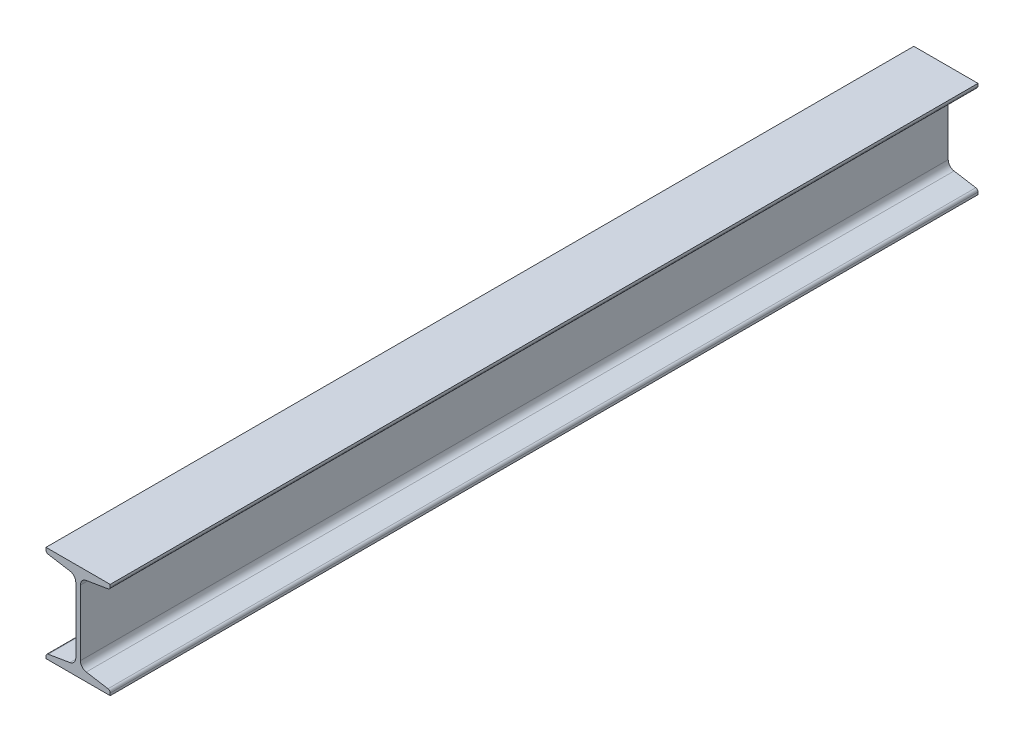
ISO-10303-21;
HEADER;
FILE_DESCRIPTION(('STEP AP214'),'2;1');
FILE_NAME('part.step','',(''),(''),'','','');
FILE_SCHEMA(('AUTOMOTIVE_DESIGN { 1 0 10303 214 1 1 1 1 }'));
ENDSEC;
DATA;
#1=APPLICATION_CONTEXT('core data for automotive mechanical design processes');
#2=APPLICATION_PROTOCOL_DEFINITION('international standard','automotive_design',2000,#1);
#3=PRODUCT_CONTEXT('',#1,'mechanical');
#4=PRODUCT('Part','Part','',(#3));
#5=PRODUCT_RELATED_PRODUCT_CATEGORY('part','',(#4));
#6=PRODUCT_DEFINITION_FORMATION('','',#4);
#7=PRODUCT_DEFINITION_CONTEXT('part definition',#1,'design');
#8=PRODUCT_DEFINITION('design','',#6,#7);
#9=PRODUCT_DEFINITION_SHAPE('','',#8);
#10=(LENGTH_UNIT() NAMED_UNIT(*) SI_UNIT(.MILLI.,.METRE.));
#11=(NAMED_UNIT(*) PLANE_ANGLE_UNIT() SI_UNIT($,.RADIAN.));
#12=(NAMED_UNIT(*) SI_UNIT($,.STERADIAN.) SOLID_ANGLE_UNIT());
#13=UNCERTAINTY_MEASURE_WITH_UNIT(LENGTH_MEASURE(1.E-05),#10,'distance_accuracy_value','');
#14=(GEOMETRIC_REPRESENTATION_CONTEXT(3) GLOBAL_UNCERTAINTY_ASSIGNED_CONTEXT((#13)) GLOBAL_UNIT_ASSIGNED_CONTEXT((#10,
#11,#12)) REPRESENTATION_CONTEXT('',''));
#15=CARTESIAN_POINT('',(0.,0.,0.));
#16=DIRECTION('',(0.,0.,1.));
#17=DIRECTION('',(1.,0.,0.));
#18=AXIS2_PLACEMENT_3D('',#15,#16,#17);
#19=CARTESIAN_POINT('',(67.6402,-4.55151905319634E-13,457.2));
#20=DIRECTION('',(0.,-1.,0.));
#21=DIRECTION('',(1.,0.,0.));
#22=AXIS2_PLACEMENT_3D('',#19,#20,#21);
#23=PLANE('',#22);
#24=DIRECTION('',(-1.,0.,0.));
#25=VECTOR('',#24,1.);
#26=CARTESIAN_POINT('',(67.6402,-4.55151905319634E-13,-457.2));
#27=LINE('',#26,#25);
#28=CARTESIAN_POINT('',(67.6402,-4.55151905319634E-13,-457.2));
#29=VERTEX_POINT('',#28);
#30=CARTESIAN_POINT('',(0.,0.,-457.2));
#31=VERTEX_POINT('',#30);
#32=EDGE_CURVE('E231',#29,#31,#27,.T.);
#33=ORIENTED_EDGE('',*,*,#32,.F.);
#34=DIRECTION('',(0.,0.,-1.));
#35=VECTOR('',#34,1.);
#36=CARTESIAN_POINT('',(67.6402,-4.55151905319634E-13,457.2));
#37=LINE('',#36,#35);
#38=CARTESIAN_POINT('',(67.6402,-4.55151905319634E-13,457.2));
#39=VERTEX_POINT('',#38);
#40=EDGE_CURVE('E189',#39,#29,#37,.T.);
#41=ORIENTED_EDGE('',*,*,#40,.F.);
#42=DIRECTION('',(-1.,0.,0.));
#43=VECTOR('',#42,1.);
#44=CARTESIAN_POINT('',(67.6402,-4.55151905319634E-13,457.2));
#45=LINE('',#44,#43);
#46=CARTESIAN_POINT('',(0.,0.,457.2));
#47=VERTEX_POINT('',#46);
#48=EDGE_CURVE('E184',#39,#47,#45,.T.);
#49=ORIENTED_EDGE('',*,*,#48,.T.);
#50=DIRECTION('',(0.,0.,-1.));
#51=VECTOR('',#50,1.);
#52=CARTESIAN_POINT('',(0.,0.,457.2));
#53=LINE('',#52,#51);
#54=EDGE_CURVE('E167',#47,#31,#53,.T.);
#55=ORIENTED_EDGE('',*,*,#54,.T.);
#56=EDGE_LOOP('',(#33,#41,#49,#55));
#57=FACE_BOUND('',#56,.T.);
#58=ADVANCED_FACE('F30',(#57),#23,.T.);
#59=CARTESIAN_POINT('',(67.6402,4.82792596957595,457.2));
#60=DIRECTION('',(1.,0.,0.));
#61=DIRECTION('',(0.,0.,-1.));
#62=AXIS2_PLACEMENT_3D('',#59,#60,#61);
#63=PLANE('',#62);
#64=DIRECTION('',(0.,-1.,0.));
#65=VECTOR('',#64,1.);
#66=CARTESIAN_POINT('',(67.6402,4.82792596957595,-457.2));
#67=LINE('',#66,#65);
#68=CARTESIAN_POINT('',(67.6402,2.46108127011071,-457.2));
#69=VERTEX_POINT('',#68);
#70=EDGE_CURVE('E190',#69,#29,#67,.T.);
#71=ORIENTED_EDGE('',*,*,#70,.F.);
#72=DIRECTION('',(0.,0.,-1.));
#73=VECTOR('',#72,1.);
#74=CARTESIAN_POINT('',(67.6402,2.46108127011071,457.2));
#75=LINE('',#74,#73);
#76=CARTESIAN_POINT('',(67.6402,2.46108127011071,457.2));
#77=VERTEX_POINT('',#76);
#78=EDGE_CURVE('E303',#69,#77,#75,.F.);
#79=ORIENTED_EDGE('',*,*,#78,.T.);
#80=DIRECTION('',(0.,-1.,0.));
#81=VECTOR('',#80,1.);
#82=CARTESIAN_POINT('',(67.6402,4.82792596957595,457.2));
#83=LINE('',#82,#81);
#84=EDGE_CURVE('E179',#77,#39,#83,.T.);
#85=ORIENTED_EDGE('',*,*,#84,.T.);
#86=ORIENTED_EDGE('',*,*,#40,.T.);
#87=EDGE_LOOP('',(#71,#79,#85,#86));
#88=FACE_BOUND('',#87,.T.);
#89=ADVANCED_FACE('F380',(#88),#63,.T.);
#90=CARTESIAN_POINT('',(42.4261511076121,9.0305740123269,457.2));
#91=DIRECTION('',(0.164410656039622,0.986391978972163,0.));
#92=DIRECTION('',(-0.986391978972163,0.164410656039622,0.));
#93=AXIS2_PLACEMENT_3D('',#90,#91,#92);
#94=PLANE('',#93);
#95=DIRECTION('',(0.986391978972163,-0.164410656039622,0.));
#96=VECTOR('',#95,1.);
#97=CARTESIAN_POINT('',(42.4261511076121,9.0305740123269,457.2));
#98=LINE('',#97,#96);
#99=CARTESIAN_POINT('',(42.4261511076121,9.0305740123269,457.2));
#100=VERTEX_POINT('',#99);
#101=CARTESIAN_POINT('',(65.3055633729747,5.21706045935893,457.2));
#102=VERTEX_POINT('',#101);
#103=EDGE_CURVE('E227',#100,#102,#98,.T.);
#104=ORIENTED_EDGE('',*,*,#103,.T.);
#105=DIRECTION('',(0.,0.,-1.));
#106=VECTOR('',#105,1.);
#107=CARTESIAN_POINT('',(65.3055633729747,5.21706045935893,457.2));
#108=LINE('',#107,#106);
#109=CARTESIAN_POINT('',(65.3055633729747,5.21706045935893,-457.2));
#110=VERTEX_POINT('',#109);
#111=EDGE_CURVE('E270',#102,#110,#108,.T.);
#112=ORIENTED_EDGE('',*,*,#111,.T.);
#113=DIRECTION('',(0.986391978972163,-0.164410656039622,0.));
#114=VECTOR('',#113,1.);
#115=CARTESIAN_POINT('',(42.4261511076121,9.0305740123269,-457.2));
#116=LINE('',#115,#114);
#117=CARTESIAN_POINT('',(42.4261511076121,9.0305740123269,-457.2));
#118=VERTEX_POINT('',#117);
#119=EDGE_CURVE('E192',#118,#110,#116,.T.);
#120=ORIENTED_EDGE('',*,*,#119,.F.);
#121=DIRECTION('',(0.,0.,-1.));
#122=VECTOR('',#121,1.);
#123=CARTESIAN_POINT('',(42.4261511076121,9.0305740123269,457.2));
#124=LINE('',#123,#122);
#125=EDGE_CURVE('E271',#100,#118,#124,.T.);
#126=ORIENTED_EDGE('',*,*,#125,.F.);
#127=EDGE_LOOP('',(#104,#112,#120,#126));
#128=FACE_BOUND('',#127,.T.);
#129=ADVANCED_FACE('F374',(#128),#94,.T.);
#130=CARTESIAN_POINT('',(43.6372,16.2963373294359,457.2));
#131=DIRECTION('',(0.,0.,-1.));
#132=DIRECTION('',(-1.,0.,0.));
#133=AXIS2_PLACEMENT_3D('',#130,#131,#132);
#134=CYLINDRICAL_SURFACE('',#133,7.366);
#135=CARTESIAN_POINT('',(43.6372,16.2963373294359,-457.2));
#136=DIRECTION('',(0.,0.,1.));
#137=DIRECTION('',(1.,0.,0.));
#138=AXIS2_PLACEMENT_3D('',#135,#136,#137);
#139=CIRCLE('',#138,7.366);
#140=CARTESIAN_POINT('',(36.2712,16.2963373294359,-457.2));
#141=VERTEX_POINT('',#140);
#142=EDGE_CURVE('E264',#141,#118,#139,.T.);
#143=ORIENTED_EDGE('',*,*,#142,.F.);
#144=DIRECTION('',(0.,0.,-1.));
#145=VECTOR('',#144,1.);
#146=CARTESIAN_POINT('',(36.2712,16.2963373294359,457.2));
#147=LINE('',#146,#145);
#148=CARTESIAN_POINT('',(36.2712,16.2963373294359,457.2));
#149=VERTEX_POINT('',#148);
#150=EDGE_CURVE('E273',#149,#141,#147,.T.);
#151=ORIENTED_EDGE('',*,*,#150,.F.);
#152=CARTESIAN_POINT('',(43.6372,16.2963373294359,457.2));
#153=DIRECTION('',(0.,0.,1.));
#154=DIRECTION('',(1.,0.,0.));
#155=AXIS2_PLACEMENT_3D('',#152,#153,#154);
#156=CIRCLE('',#155,7.366);
#157=EDGE_CURVE('E224',#149,#100,#156,.T.);
#158=ORIENTED_EDGE('',*,*,#157,.T.);
#159=ORIENTED_EDGE('',*,*,#125,.T.);
#160=EDGE_LOOP('',(#143,#151,#158,#159));
#161=FACE_BOUND('',#160,.T.);
#162=ADVANCED_FACE('F370',(#161),#134,.F.);
#163=CARTESIAN_POINT('',(36.2712,85.3036626705632,457.2));
#164=DIRECTION('',(1.,0.,0.));
#165=DIRECTION('',(0.,1.,0.));
#166=AXIS2_PLACEMENT_3D('',#163,#164,#165);
#167=PLANE('',#166);
#168=DIRECTION('',(0.,-1.,0.));
#169=VECTOR('',#168,1.);
#170=CARTESIAN_POINT('',(36.2712,85.3036626705632,-457.2));
#171=LINE('',#170,#169);
#172=CARTESIAN_POINT('',(36.2712,85.3036626705632,-457.2));
#173=VERTEX_POINT('',#172);
#174=EDGE_CURVE('E261',#173,#141,#171,.T.);
#175=ORIENTED_EDGE('',*,*,#174,.F.);
#176=DIRECTION('',(0.,0.,-1.));
#177=VECTOR('',#176,1.);
#178=CARTESIAN_POINT('',(36.2712,85.3036626705632,457.2));
#179=LINE('',#178,#177);
#180=CARTESIAN_POINT('',(36.2712,85.3036626705632,457.2));
#181=VERTEX_POINT('',#180);
#182=EDGE_CURVE('E275',#181,#173,#179,.T.);
#183=ORIENTED_EDGE('',*,*,#182,.F.);
#184=DIRECTION('',(0.,-1.,0.));
#185=VECTOR('',#184,1.);
#186=CARTESIAN_POINT('',(36.2712,85.3036626705632,457.2));
#187=LINE('',#186,#185);
#188=EDGE_CURVE('E221',#181,#149,#187,.T.);
#189=ORIENTED_EDGE('',*,*,#188,.T.);
#190=ORIENTED_EDGE('',*,*,#150,.T.);
#191=EDGE_LOOP('',(#175,#183,#189,#190));
#192=FACE_BOUND('',#191,.T.);
#193=ADVANCED_FACE('F366',(#192),#167,.T.);
#194=CARTESIAN_POINT('',(43.6372,85.3036626705632,457.2));
#195=DIRECTION('',(0.,0.,-1.));
#196=DIRECTION('',(-1.,0.,0.));
#197=AXIS2_PLACEMENT_3D('',#194,#195,#196);
#198=CYLINDRICAL_SURFACE('',#197,7.366);
#199=CARTESIAN_POINT('',(43.6372,85.3036626705632,-457.2));
#200=DIRECTION('',(0.,0.,1.));
#201=DIRECTION('',(1.,0.,0.));
#202=AXIS2_PLACEMENT_3D('',#199,#200,#201);
#203=CIRCLE('',#202,7.366);
#204=CARTESIAN_POINT('',(42.4261511076121,92.5694259876721,-457.2));
#205=VERTEX_POINT('',#204);
#206=EDGE_CURVE('E258',#205,#173,#203,.T.);
#207=ORIENTED_EDGE('',*,*,#206,.F.);
#208=DIRECTION('',(0.,0.,-1.));
#209=VECTOR('',#208,1.);
#210=CARTESIAN_POINT('',(42.4261511076121,92.5694259876721,457.2));
#211=LINE('',#210,#209);
#212=CARTESIAN_POINT('',(42.4261511076121,92.5694259876721,457.2));
#213=VERTEX_POINT('',#212);
#214=EDGE_CURVE('E277',#213,#205,#211,.T.);
#215=ORIENTED_EDGE('',*,*,#214,.F.);
#216=CARTESIAN_POINT('',(43.6372,85.3036626705632,457.2));
#217=DIRECTION('',(0.,0.,1.));
#218=DIRECTION('',(1.,0.,0.));
#219=AXIS2_PLACEMENT_3D('',#216,#217,#218);
#220=CIRCLE('',#219,7.366);
#221=EDGE_CURVE('E218',#213,#181,#220,.T.);
#222=ORIENTED_EDGE('',*,*,#221,.T.);
#223=ORIENTED_EDGE('',*,*,#182,.T.);
#224=EDGE_LOOP('',(#207,#215,#222,#223));
#225=FACE_BOUND('',#224,.T.);
#226=ADVANCED_FACE('F362',(#225),#198,.F.);
#227=CARTESIAN_POINT('',(67.6402,96.7720740304231,457.2));
#228=DIRECTION('',(0.164410656039624,-0.986391978972163,0.));
#229=DIRECTION('',(0.986391978972163,0.164410656039624,0.));
#230=AXIS2_PLACEMENT_3D('',#227,#228,#229);
#231=PLANE('',#230);
#232=DIRECTION('',(-0.986391978972163,-0.164410656039624,0.));
#233=VECTOR('',#232,1.);
#234=CARTESIAN_POINT('',(67.6402,96.7720740304231,-457.2));
#235=LINE('',#234,#233);
#236=CARTESIAN_POINT('',(65.3055633729747,96.3829395406401,-457.2));
#237=VERTEX_POINT('',#236);
#238=EDGE_CURVE('E256',#237,#205,#235,.T.);
#239=ORIENTED_EDGE('',*,*,#238,.F.);
#240=DIRECTION('',(0.,0.,-1.));
#241=VECTOR('',#240,1.);
#242=CARTESIAN_POINT('',(65.3055633729747,96.3829395406401,457.2));
#243=LINE('',#242,#241);
#244=CARTESIAN_POINT('',(65.3055633729747,96.3829395406401,457.2));
#245=VERTEX_POINT('',#244);
#246=EDGE_CURVE('E318',#237,#245,#243,.F.);
#247=ORIENTED_EDGE('',*,*,#246,.T.);
#248=DIRECTION('',(-0.986391978972163,-0.164410656039624,0.));
#249=VECTOR('',#248,1.);
#250=CARTESIAN_POINT('',(67.6402,96.7720740304231,457.2));
#251=LINE('',#250,#249);
#252=EDGE_CURVE('E216',#245,#213,#251,.T.);
#253=ORIENTED_EDGE('',*,*,#252,.T.);
#254=ORIENTED_EDGE('',*,*,#214,.T.);
#255=EDGE_LOOP('',(#239,#247,#253,#254));
#256=FACE_BOUND('',#255,.T.);
#257=ADVANCED_FACE('F356',(#256),#231,.T.);
#258=CARTESIAN_POINT('',(67.6402,101.6,457.2));
#259=DIRECTION('',(1.,0.,0.));
#260=DIRECTION('',(0.,0.,-1.));
#261=AXIS2_PLACEMENT_3D('',#258,#259,#260);
#262=PLANE('',#261);
#263=DIRECTION('',(0.,-1.,0.));
#264=VECTOR('',#263,1.);
#265=CARTESIAN_POINT('',(67.6402,101.6,457.2));
#266=LINE('',#265,#264);
#267=CARTESIAN_POINT('',(67.6402,101.6,457.2));
#268=VERTEX_POINT('',#267);
#269=CARTESIAN_POINT('',(67.6402,99.1389187298884,457.2));
#270=VERTEX_POINT('',#269);
#271=EDGE_CURVE('E213',#268,#270,#266,.T.);
#272=ORIENTED_EDGE('',*,*,#271,.T.);
#273=DIRECTION('',(0.,0.,-1.));
#274=VECTOR('',#273,1.);
#275=CARTESIAN_POINT('',(67.6402,99.1389187298884,457.2));
#276=LINE('',#275,#274);
#277=CARTESIAN_POINT('',(67.6402,99.1389187298884,-457.2));
#278=VERTEX_POINT('',#277);
#279=EDGE_CURVE('E315',#270,#278,#276,.T.);
#280=ORIENTED_EDGE('',*,*,#279,.T.);
#281=DIRECTION('',(0.,-1.,0.));
#282=VECTOR('',#281,1.);
#283=CARTESIAN_POINT('',(67.6402,101.6,-457.2));
#284=LINE('',#283,#282);
#285=CARTESIAN_POINT('',(67.6402,101.6,-457.2));
#286=VERTEX_POINT('',#285);
#287=EDGE_CURVE('E253',#286,#278,#284,.T.);
#288=ORIENTED_EDGE('',*,*,#287,.F.);
#289=DIRECTION('',(0.,0.,-1.));
#290=VECTOR('',#289,1.);
#291=CARTESIAN_POINT('',(67.6402,101.6,457.2));
#292=LINE('',#291,#290);
#293=EDGE_CURVE('E280',#268,#286,#292,.T.);
#294=ORIENTED_EDGE('',*,*,#293,.F.);
#295=EDGE_LOOP('',(#272,#280,#288,#294));
#296=FACE_BOUND('',#295,.T.);
#297=ADVANCED_FACE('F348',(#296),#262,.T.);
#298=CARTESIAN_POINT('',(0.,101.6,457.2));
#299=DIRECTION('',(0.,1.,0.));
#300=DIRECTION('',(-1.,0.,0.));
#301=AXIS2_PLACEMENT_3D('',#298,#299,#300);
#302=PLANE('',#301);
#303=DIRECTION('',(1.,0.,0.));
#304=VECTOR('',#303,1.);
#305=CARTESIAN_POINT('',(0.,101.6,-457.2));
#306=LINE('',#305,#304);
#307=CARTESIAN_POINT('',(0.,101.6,-457.2));
#308=VERTEX_POINT('',#307);
#309=EDGE_CURVE('E250',#308,#286,#306,.T.);
#310=ORIENTED_EDGE('',*,*,#309,.F.);
#311=DIRECTION('',(0.,0.,-1.));
#312=VECTOR('',#311,1.);
#313=CARTESIAN_POINT('',(0.,101.6,457.2));
#314=LINE('',#313,#312);
#315=CARTESIAN_POINT('',(0.,101.6,457.2));
#316=VERTEX_POINT('',#315);
#317=EDGE_CURVE('E282',#316,#308,#314,.T.);
#318=ORIENTED_EDGE('',*,*,#317,.F.);
#319=DIRECTION('',(1.,0.,0.));
#320=VECTOR('',#319,1.);
#321=CARTESIAN_POINT('',(0.,101.6,457.2));
#322=LINE('',#321,#320);
#323=EDGE_CURVE('E210',#316,#268,#322,.T.);
#324=ORIENTED_EDGE('',*,*,#323,.T.);
#325=ORIENTED_EDGE('',*,*,#293,.T.);
#326=EDGE_LOOP('',(#310,#318,#324,#325));
#327=FACE_BOUND('',#326,.T.);
#328=ADVANCED_FACE('F345',(#327),#302,.T.);
#329=CARTESIAN_POINT('',(0.,96.7720740304231,457.2));
#330=DIRECTION('',(-1.,0.,0.));
#331=DIRECTION('',(0.,-1.,0.));
#332=AXIS2_PLACEMENT_3D('',#329,#330,#331);
#333=PLANE('',#332);
#334=DIRECTION('',(0.,1.,0.));
#335=VECTOR('',#334,1.);
#336=CARTESIAN_POINT('',(0.,96.7720740304231,-457.2));
#337=LINE('',#336,#335);
#338=CARTESIAN_POINT('',(0.,99.1389187298884,-457.2));
#339=VERTEX_POINT('',#338);
#340=EDGE_CURVE('E248',#339,#308,#337,.T.);
#341=ORIENTED_EDGE('',*,*,#340,.F.);
#342=DIRECTION('',(0.,0.,-1.));
#343=VECTOR('',#342,1.);
#344=CARTESIAN_POINT('',(0.,99.1389187298884,457.2));
#345=LINE('',#344,#343);
#346=CARTESIAN_POINT('',(0.,99.1389187298884,457.2));
#347=VERTEX_POINT('',#346);
#348=EDGE_CURVE('E11',#339,#347,#345,.F.);
#349=ORIENTED_EDGE('',*,*,#348,.T.);
#350=DIRECTION('',(0.,1.,0.));
#351=VECTOR('',#350,1.);
#352=CARTESIAN_POINT('',(0.,96.7720740304231,457.2));
#353=LINE('',#352,#351);
#354=EDGE_CURVE('E208',#347,#316,#353,.T.);
#355=ORIENTED_EDGE('',*,*,#354,.T.);
#356=ORIENTED_EDGE('',*,*,#317,.T.);
#357=EDGE_LOOP('',(#341,#349,#355,#356));
#358=FACE_BOUND('',#357,.T.);
#359=ADVANCED_FACE('F340',(#358),#333,.T.);
#360=CARTESIAN_POINT('',(25.2140488923878,92.5694259876721,457.2));
#361=DIRECTION('',(-0.164410656039623,-0.986391978972163,0.));
#362=DIRECTION('',(0.986391978972163,-0.164410656039623,0.));
#363=AXIS2_PLACEMENT_3D('',#360,#361,#362);
#364=PLANE('',#363);
#365=DIRECTION('',(-0.986391978972163,0.164410656039623,0.));
#366=VECTOR('',#365,1.);
#367=CARTESIAN_POINT('',(25.2140488923878,92.5694259876721,457.2));
#368=LINE('',#367,#366);
#369=CARTESIAN_POINT('',(25.2140488923878,92.5694259876721,457.2));
#370=VERTEX_POINT('',#369);
#371=CARTESIAN_POINT('',(2.33463662702527,96.3829395406401,457.2));
#372=VERTEX_POINT('',#371);
#373=EDGE_CURVE('E205',#370,#372,#368,.T.);
#374=ORIENTED_EDGE('',*,*,#373,.T.);
#375=DIRECTION('',(0.,0.,-1.));
#376=VECTOR('',#375,1.);
#377=CARTESIAN_POINT('',(2.33463662702526,96.3829395406401,457.2));
#378=LINE('',#377,#376);
#379=CARTESIAN_POINT('',(2.33463662702527,96.3829395406401,-457.2));
#380=VERTEX_POINT('',#379);
#381=EDGE_CURVE('E38',#372,#380,#378,.T.);
#382=ORIENTED_EDGE('',*,*,#381,.T.);
#383=DIRECTION('',(-0.986391978972163,0.164410656039623,0.));
#384=VECTOR('',#383,1.);
#385=CARTESIAN_POINT('',(25.2140488923878,92.5694259876721,-457.2));
#386=LINE('',#385,#384);
#387=CARTESIAN_POINT('',(25.2140488923878,92.5694259876721,-457.2));
#388=VERTEX_POINT('',#387);
#389=EDGE_CURVE('E245',#388,#380,#386,.T.);
#390=ORIENTED_EDGE('',*,*,#389,.F.);
#391=DIRECTION('',(0.,0.,-1.));
#392=VECTOR('',#391,1.);
#393=CARTESIAN_POINT('',(25.2140488923878,92.5694259876721,457.2));
#394=LINE('',#393,#392);
#395=EDGE_CURVE('E285',#370,#388,#394,.T.);
#396=ORIENTED_EDGE('',*,*,#395,.F.);
#397=EDGE_LOOP('',(#374,#382,#390,#396));
#398=FACE_BOUND('',#397,.T.);
#399=ADVANCED_FACE('F323',(#398),#364,.T.);
#400=CARTESIAN_POINT('',(24.003,85.3036626705632,457.2));
#401=DIRECTION('',(0.,0.,-1.));
#402=DIRECTION('',(-1.,0.,0.));
#403=AXIS2_PLACEMENT_3D('',#400,#401,#402);
#404=CYLINDRICAL_SURFACE('',#403,7.366);
#405=CARTESIAN_POINT('',(24.003,85.3036626705632,-457.2));
#406=DIRECTION('',(0.,0.,1.));
#407=DIRECTION('',(1.,0.,0.));
#408=AXIS2_PLACEMENT_3D('',#405,#406,#407);
#409=CIRCLE('',#408,7.366);
#410=CARTESIAN_POINT('',(31.369,85.3036626705632,-457.2));
#411=VERTEX_POINT('',#410);
#412=EDGE_CURVE('E242',#411,#388,#409,.T.);
#413=ORIENTED_EDGE('',*,*,#412,.F.);
#414=DIRECTION('',(0.,0.,-1.));
#415=VECTOR('',#414,1.);
#416=CARTESIAN_POINT('',(31.369,85.3036626705632,457.2));
#417=LINE('',#416,#415);
#418=CARTESIAN_POINT('',(31.369,85.3036626705632,457.2));
#419=VERTEX_POINT('',#418);
#420=EDGE_CURVE('E287',#419,#411,#417,.T.);
#421=ORIENTED_EDGE('',*,*,#420,.F.);
#422=CARTESIAN_POINT('',(24.003,85.3036626705632,457.2));
#423=DIRECTION('',(0.,0.,1.));
#424=DIRECTION('',(1.,0.,0.));
#425=AXIS2_PLACEMENT_3D('',#422,#423,#424);
#426=CIRCLE('',#425,7.366);
#427=EDGE_CURVE('E202',#419,#370,#426,.T.);
#428=ORIENTED_EDGE('',*,*,#427,.T.);
#429=ORIENTED_EDGE('',*,*,#395,.T.);
#430=EDGE_LOOP('',(#413,#421,#428,#429));
#431=FACE_BOUND('',#430,.T.);
#432=ADVANCED_FACE('F333',(#431),#404,.F.);
#433=CARTESIAN_POINT('',(31.369,16.2963373294359,457.2));
#434=DIRECTION('',(-1.,0.,0.));
#435=DIRECTION('',(0.,-1.,0.));
#436=AXIS2_PLACEMENT_3D('',#433,#434,#435);
#437=PLANE('',#436);
#438=DIRECTION('',(0.,1.,0.));
#439=VECTOR('',#438,1.);
#440=CARTESIAN_POINT('',(31.369,16.2963373294359,-457.2));
#441=LINE('',#440,#439);
#442=CARTESIAN_POINT('',(31.369,16.2963373294359,-457.2));
#443=VERTEX_POINT('',#442);
#444=EDGE_CURVE('E239',#443,#411,#441,.T.);
#445=ORIENTED_EDGE('',*,*,#444,.F.);
#446=DIRECTION('',(0.,0.,-1.));
#447=VECTOR('',#446,1.);
#448=CARTESIAN_POINT('',(31.369,16.2963373294359,457.2));
#449=LINE('',#448,#447);
#450=CARTESIAN_POINT('',(31.369,16.2963373294359,457.2));
#451=VERTEX_POINT('',#450);
#452=EDGE_CURVE('E289',#451,#443,#449,.T.);
#453=ORIENTED_EDGE('',*,*,#452,.F.);
#454=DIRECTION('',(0.,1.,0.));
#455=VECTOR('',#454,1.);
#456=CARTESIAN_POINT('',(31.369,16.2963373294359,457.2));
#457=LINE('',#456,#455);
#458=EDGE_CURVE('E199',#451,#419,#457,.T.);
#459=ORIENTED_EDGE('',*,*,#458,.T.);
#460=ORIENTED_EDGE('',*,*,#420,.T.);
#461=EDGE_LOOP('',(#445,#453,#459,#460));
#462=FACE_BOUND('',#461,.T.);
#463=ADVANCED_FACE('F408',(#462),#437,.T.);
#464=CARTESIAN_POINT('',(24.003,16.2963373294359,457.2));
#465=DIRECTION('',(0.,0.,-1.));
#466=DIRECTION('',(-1.,0.,0.));
#467=AXIS2_PLACEMENT_3D('',#464,#465,#466);
#468=CYLINDRICAL_SURFACE('',#467,7.366);
#469=CARTESIAN_POINT('',(24.003,16.2963373294359,-457.2));
#470=DIRECTION('',(0.,0.,1.));
#471=DIRECTION('',(1.,0.,0.));
#472=AXIS2_PLACEMENT_3D('',#469,#470,#471);
#473=CIRCLE('',#472,7.366);
#474=CARTESIAN_POINT('',(25.2140488923878,9.0305740123269,-457.2));
#475=VERTEX_POINT('',#474);
#476=EDGE_CURVE('E236',#475,#443,#473,.T.);
#477=ORIENTED_EDGE('',*,*,#476,.F.);
#478=DIRECTION('',(0.,0.,-1.));
#479=VECTOR('',#478,1.);
#480=CARTESIAN_POINT('',(25.2140488923878,9.0305740123269,457.2));
#481=LINE('',#480,#479);
#482=CARTESIAN_POINT('',(25.2140488923878,9.0305740123269,457.2));
#483=VERTEX_POINT('',#482);
#484=EDGE_CURVE('E178',#483,#475,#481,.T.);
#485=ORIENTED_EDGE('',*,*,#484,.F.);
#486=CARTESIAN_POINT('',(24.003,16.2963373294359,457.2));
#487=DIRECTION('',(0.,0.,1.));
#488=DIRECTION('',(1.,0.,0.));
#489=AXIS2_PLACEMENT_3D('',#486,#487,#488);
#490=CIRCLE('',#489,7.366);
#491=EDGE_CURVE('E196',#483,#451,#490,.T.);
#492=ORIENTED_EDGE('',*,*,#491,.T.);
#493=ORIENTED_EDGE('',*,*,#452,.T.);
#494=EDGE_LOOP('',(#477,#485,#492,#493));
#495=FACE_BOUND('',#494,.T.);
#496=ADVANCED_FACE('F405',(#495),#468,.F.);
#497=CARTESIAN_POINT('',(0.,4.82792596957594,457.2));
#498=DIRECTION('',(-0.164410656039623,0.986391978972163,0.));
#499=DIRECTION('',(-0.986391978972163,-0.164410656039623,0.));
#500=AXIS2_PLACEMENT_3D('',#497,#498,#499);
#501=PLANE('',#500);
#502=DIRECTION('',(0.986391978972164,0.164410656039623,0.));
#503=VECTOR('',#502,1.);
#504=CARTESIAN_POINT('',(0.,4.82792596957594,-457.2));
#505=LINE('',#504,#503);
#506=CARTESIAN_POINT('',(2.33463662702529,5.21706045935893,-457.2));
#507=VERTEX_POINT('',#506);
#508=EDGE_CURVE('E234',#507,#475,#505,.T.);
#509=ORIENTED_EDGE('',*,*,#508,.F.);
#510=DIRECTION('',(0.,0.,-1.));
#511=VECTOR('',#510,1.);
#512=CARTESIAN_POINT('',(2.33463662702529,5.21706045935893,457.2));
#513=LINE('',#512,#511);
#514=CARTESIAN_POINT('',(2.33463662702529,5.21706045935893,457.2));
#515=VERTEX_POINT('',#514);
#516=EDGE_CURVE('E53',#507,#515,#513,.F.);
#517=ORIENTED_EDGE('',*,*,#516,.T.);
#518=DIRECTION('',(0.986391978972164,0.164410656039623,0.));
#519=VECTOR('',#518,1.);
#520=CARTESIAN_POINT('',(0.,4.82792596957594,457.2));
#521=LINE('',#520,#519);
#522=EDGE_CURVE('E185',#515,#483,#521,.T.);
#523=ORIENTED_EDGE('',*,*,#522,.T.);
#524=ORIENTED_EDGE('',*,*,#484,.T.);
#525=EDGE_LOOP('',(#509,#517,#523,#524));
#526=FACE_BOUND('',#525,.T.);
#527=ADVANCED_FACE('F402',(#526),#501,.T.);
#528=CARTESIAN_POINT('',(0.,0.,457.2));
#529=DIRECTION('',(-1.,0.,0.));
#530=DIRECTION('',(0.,-1.,0.));
#531=AXIS2_PLACEMENT_3D('',#528,#529,#530);
#532=PLANE('',#531);
#533=DIRECTION('',(0.,1.,0.));
#534=VECTOR('',#533,1.);
#535=CARTESIAN_POINT('',(0.,0.,457.2));
#536=LINE('',#535,#534);
#537=CARTESIAN_POINT('',(0.,2.46108127011069,457.2));
#538=VERTEX_POINT('',#537);
#539=EDGE_CURVE('E170',#47,#538,#536,.T.);
#540=ORIENTED_EDGE('',*,*,#539,.T.);
#541=DIRECTION('',(0.,0.,-1.));
#542=VECTOR('',#541,1.);
#543=CARTESIAN_POINT('',(0.,2.46108127011069,457.2));
#544=LINE('',#543,#542);
#545=CARTESIAN_POINT('',(0.,2.46108127011069,-457.2));
#546=VERTEX_POINT('',#545);
#547=EDGE_CURVE('E312',#538,#546,#544,.T.);
#548=ORIENTED_EDGE('',*,*,#547,.T.);
#549=DIRECTION('',(0.,1.,0.));
#550=VECTOR('',#549,1.);
#551=CARTESIAN_POINT('',(0.,0.,-457.2));
#552=LINE('',#551,#550);
#553=EDGE_CURVE('E173',#31,#546,#552,.T.);
#554=ORIENTED_EDGE('',*,*,#553,.F.);
#555=ORIENTED_EDGE('',*,*,#54,.F.);
#556=EDGE_LOOP('',(#540,#548,#554,#555));
#557=FACE_BOUND('',#556,.T.);
#558=ADVANCED_FACE('F168',(#557),#532,.T.);
#559=CARTESIAN_POINT('',(24.003,16.2963373294359,457.2));
#560=DIRECTION('',(0.,0.,1.));
#561=DIRECTION('',(1.,0.,0.));
#562=AXIS2_PLACEMENT_3D('',#559,#560,#561);
#563=PLANE('',#562);
#564=ORIENTED_EDGE('',*,*,#84,.F.);
#565=CARTESIAN_POINT('',(64.8462,2.46108127011071,457.2));
#566=DIRECTION('',(0.,0.,1.));
#567=DIRECTION('',(1.,0.,0.));
#568=AXIS2_PLACEMENT_3D('',#565,#566,#567);
#569=CIRCLE('',#568,2.794);
#570=EDGE_CURVE('E310',#77,#102,#569,.T.);
#571=ORIENTED_EDGE('',*,*,#570,.T.);
#572=ORIENTED_EDGE('',*,*,#103,.F.);
#573=ORIENTED_EDGE('',*,*,#157,.F.);
#574=ORIENTED_EDGE('',*,*,#188,.F.);
#575=ORIENTED_EDGE('',*,*,#221,.F.);
#576=ORIENTED_EDGE('',*,*,#252,.F.);
#577=CARTESIAN_POINT('',(64.8462,99.1389187298884,457.2));
#578=DIRECTION('',(0.,0.,1.));
#579=DIRECTION('',(1.,0.,0.));
#580=AXIS2_PLACEMENT_3D('',#577,#578,#579);
#581=CIRCLE('',#580,2.794);
#582=EDGE_CURVE('E307',#245,#270,#581,.T.);
#583=ORIENTED_EDGE('',*,*,#582,.T.);
#584=ORIENTED_EDGE('',*,*,#271,.F.);
#585=ORIENTED_EDGE('',*,*,#323,.F.);
#586=ORIENTED_EDGE('',*,*,#354,.F.);
#587=CARTESIAN_POINT('',(2.79399999999997,99.1389187298884,457.2));
#588=DIRECTION('',(0.,0.,1.));
#589=DIRECTION('',(1.,0.,0.));
#590=AXIS2_PLACEMENT_3D('',#587,#588,#589);
#591=CIRCLE('',#590,2.794);
#592=EDGE_CURVE('E305',#347,#372,#591,.T.);
#593=ORIENTED_EDGE('',*,*,#592,.T.);
#594=ORIENTED_EDGE('',*,*,#373,.F.);
#595=ORIENTED_EDGE('',*,*,#427,.F.);
#596=ORIENTED_EDGE('',*,*,#458,.F.);
#597=ORIENTED_EDGE('',*,*,#491,.F.);
#598=ORIENTED_EDGE('',*,*,#522,.F.);
#599=CARTESIAN_POINT('',(2.79399999999999,2.4610812701107,457.2));
#600=DIRECTION('',(0.,0.,1.));
#601=DIRECTION('',(1.,0.,0.));
#602=AXIS2_PLACEMENT_3D('',#599,#600,#601);
#603=CIRCLE('',#602,2.794);
#604=EDGE_CURVE('E45',#515,#538,#603,.T.);
#605=ORIENTED_EDGE('',*,*,#604,.T.);
#606=ORIENTED_EDGE('',*,*,#539,.F.);
#607=ORIENTED_EDGE('',*,*,#48,.F.);
#608=EDGE_LOOP('',(#564,#571,#572,#573,#574,#575,#576,#583,#584,#585,#586,#593,#594,#595,#596,
#597,#598,#605,#606,#607));
#609=FACE_BOUND('',#608,.T.);
#610=ADVANCED_FACE('F183',(#609),#563,.T.);
#611=CARTESIAN_POINT('',(24.003,16.2963373294359,-457.2));
#612=DIRECTION('',(0.,0.,1.));
#613=DIRECTION('',(1.,0.,0.));
#614=AXIS2_PLACEMENT_3D('',#611,#612,#613);
#615=PLANE('',#614);
#616=ORIENTED_EDGE('',*,*,#119,.T.);
#617=CARTESIAN_POINT('',(64.8462,2.46108127011071,-457.2));
#618=DIRECTION('',(0.,0.,1.));
#619=DIRECTION('',(1.,0.,0.));
#620=AXIS2_PLACEMENT_3D('',#617,#618,#619);
#621=CIRCLE('',#620,2.794);
#622=EDGE_CURVE('E301',#110,#69,#621,.F.);
#623=ORIENTED_EDGE('',*,*,#622,.T.);
#624=ORIENTED_EDGE('',*,*,#70,.T.);
#625=ORIENTED_EDGE('',*,*,#32,.T.);
#626=ORIENTED_EDGE('',*,*,#553,.T.);
#627=CARTESIAN_POINT('',(2.79399999999999,2.4610812701107,-457.2));
#628=DIRECTION('',(0.,0.,1.));
#629=DIRECTION('',(1.,0.,0.));
#630=AXIS2_PLACEMENT_3D('',#627,#628,#629);
#631=CIRCLE('',#630,2.794);
#632=EDGE_CURVE('E299',#546,#507,#631,.F.);
#633=ORIENTED_EDGE('',*,*,#632,.T.);
#634=ORIENTED_EDGE('',*,*,#508,.T.);
#635=ORIENTED_EDGE('',*,*,#476,.T.);
#636=ORIENTED_EDGE('',*,*,#444,.T.);
#637=ORIENTED_EDGE('',*,*,#412,.T.);
#638=ORIENTED_EDGE('',*,*,#389,.T.);
#639=CARTESIAN_POINT('',(2.79399999999997,99.1389187298884,-457.2));
#640=DIRECTION('',(0.,0.,1.));
#641=DIRECTION('',(1.,0.,0.));
#642=AXIS2_PLACEMENT_3D('',#639,#640,#641);
#643=CIRCLE('',#642,2.794);
#644=EDGE_CURVE('E295',#380,#339,#643,.F.);
#645=ORIENTED_EDGE('',*,*,#644,.T.);
#646=ORIENTED_EDGE('',*,*,#340,.T.);
#647=ORIENTED_EDGE('',*,*,#309,.T.);
#648=ORIENTED_EDGE('',*,*,#287,.T.);
#649=CARTESIAN_POINT('',(64.8462,99.1389187298884,-457.2));
#650=DIRECTION('',(0.,0.,1.));
#651=DIRECTION('',(1.,0.,0.));
#652=AXIS2_PLACEMENT_3D('',#649,#650,#651);
#653=CIRCLE('',#652,2.794);
#654=EDGE_CURVE('E297',#278,#237,#653,.F.);
#655=ORIENTED_EDGE('',*,*,#654,.T.);
#656=ORIENTED_EDGE('',*,*,#238,.T.);
#657=ORIENTED_EDGE('',*,*,#206,.T.);
#658=ORIENTED_EDGE('',*,*,#174,.T.);
#659=ORIENTED_EDGE('',*,*,#142,.T.);
#660=EDGE_LOOP('',(#616,#623,#624,#625,#626,#633,#634,#635,#636,#637,#638,#645,#646,#647,#648,
#655,#656,#657,#658,#659));
#661=FACE_BOUND('',#660,.T.);
#662=ADVANCED_FACE('F328',(#661),#615,.F.);
#663=CARTESIAN_POINT('',(64.8462,2.46108127011071,457.2));
#664=DIRECTION('',(0.,0.,-1.));
#665=DIRECTION('',(-1.,0.,0.));
#666=AXIS2_PLACEMENT_3D('',#663,#664,#665);
#667=CYLINDRICAL_SURFACE('',#666,2.794);
#668=ORIENTED_EDGE('',*,*,#570,.F.);
#669=ORIENTED_EDGE('',*,*,#78,.F.);
#670=ORIENTED_EDGE('',*,*,#622,.F.);
#671=ORIENTED_EDGE('',*,*,#111,.F.);
#672=EDGE_LOOP('',(#668,#669,#670,#671));
#673=FACE_BOUND('',#672,.T.);
#674=ADVANCED_FACE('F382',(#673),#667,.T.);
#675=CARTESIAN_POINT('',(2.79399999999999,2.4610812701107,457.2));
#676=DIRECTION('',(0.,0.,-1.));
#677=DIRECTION('',(-1.,0.,0.));
#678=AXIS2_PLACEMENT_3D('',#675,#676,#677);
#679=CYLINDRICAL_SURFACE('',#678,2.794);
#680=ORIENTED_EDGE('',*,*,#604,.F.);
#681=ORIENTED_EDGE('',*,*,#516,.F.);
#682=ORIENTED_EDGE('',*,*,#632,.F.);
#683=ORIENTED_EDGE('',*,*,#547,.F.);
#684=EDGE_LOOP('',(#680,#681,#682,#683));
#685=FACE_BOUND('',#684,.T.);
#686=ADVANCED_FACE('F384',(#685),#679,.T.);
#687=CARTESIAN_POINT('',(64.8462,99.1389187298884,457.2));
#688=DIRECTION('',(0.,0.,-1.));
#689=DIRECTION('',(-1.,0.,0.));
#690=AXIS2_PLACEMENT_3D('',#687,#688,#689);
#691=CYLINDRICAL_SURFACE('',#690,2.794);
#692=ORIENTED_EDGE('',*,*,#582,.F.);
#693=ORIENTED_EDGE('',*,*,#246,.F.);
#694=ORIENTED_EDGE('',*,*,#654,.F.);
#695=ORIENTED_EDGE('',*,*,#279,.F.);
#696=EDGE_LOOP('',(#692,#693,#694,#695));
#697=FACE_BOUND('',#696,.T.);
#698=ADVANCED_FACE('F352',(#697),#691,.T.);
#699=CARTESIAN_POINT('',(2.79399999999997,99.1389187298884,457.2));
#700=DIRECTION('',(0.,0.,-1.));
#701=DIRECTION('',(-1.,0.,0.));
#702=AXIS2_PLACEMENT_3D('',#699,#700,#701);
#703=CYLINDRICAL_SURFACE('',#702,2.794);
#704=ORIENTED_EDGE('',*,*,#592,.F.);
#705=ORIENTED_EDGE('',*,*,#348,.F.);
#706=ORIENTED_EDGE('',*,*,#644,.F.);
#707=ORIENTED_EDGE('',*,*,#381,.F.);
#708=EDGE_LOOP('',(#704,#705,#706,#707));
#709=FACE_BOUND('',#708,.T.);
#710=ADVANCED_FACE('F32',(#709),#703,.T.);
#711=CLOSED_SHELL('',(#58,#89,#129,#162,#193,#226,#257,#297,#328,#359,#399,#432,#463,#496,#527,
#558,#610,#662,#674,#686,#698,#710));
#712=MANIFOLD_SOLID_BREP('B2',#711);
#713=ADVANCED_BREP_SHAPE_REPRESENTATION('',(#18,#712),#14);
#714=SHAPE_DEFINITION_REPRESENTATION(#9,#713);
ENDSEC;
END-ISO-10303-21;
